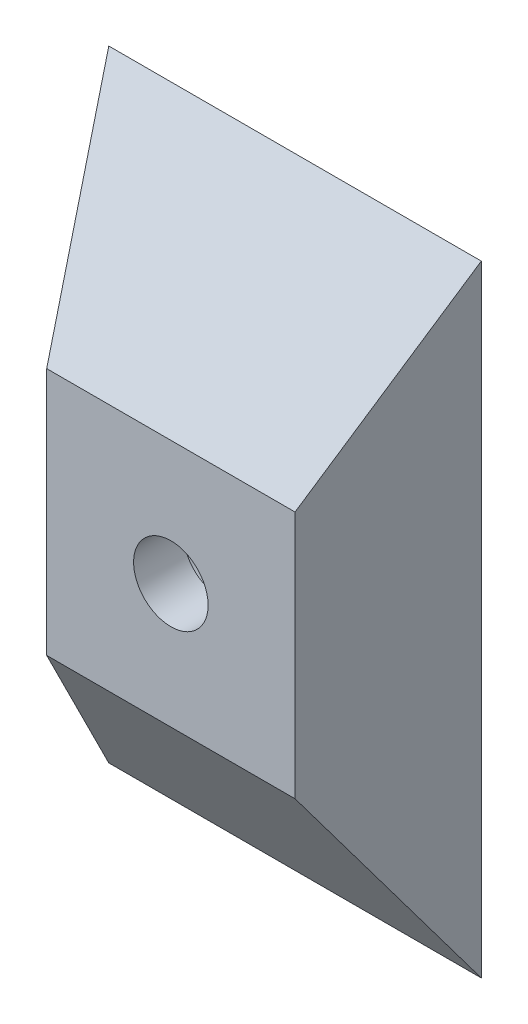
ISO-10303-21;
HEADER;
FILE_DESCRIPTION(('STEP AP214'),'2;1');
FILE_NAME('part.step','',(''),(''),'','','');
FILE_SCHEMA(('AUTOMOTIVE_DESIGN { 1 0 10303 214 1 1 1 1 }'));
ENDSEC;
DATA;
#1=APPLICATION_CONTEXT('core data for automotive mechanical design processes');
#2=APPLICATION_PROTOCOL_DEFINITION('international standard','automotive_design',2000,#1);
#3=PRODUCT_CONTEXT('',#1,'mechanical');
#4=PRODUCT('Part','Part','',(#3));
#5=PRODUCT_RELATED_PRODUCT_CATEGORY('part','',(#4));
#6=PRODUCT_DEFINITION_FORMATION('','',#4);
#7=PRODUCT_DEFINITION_CONTEXT('part definition',#1,'design');
#8=PRODUCT_DEFINITION('design','',#6,#7);
#9=PRODUCT_DEFINITION_SHAPE('','',#8);
#10=(LENGTH_UNIT() NAMED_UNIT(*) SI_UNIT(.MILLI.,.METRE.));
#11=(NAMED_UNIT(*) PLANE_ANGLE_UNIT() SI_UNIT($,.RADIAN.));
#12=(NAMED_UNIT(*) SI_UNIT($,.STERADIAN.) SOLID_ANGLE_UNIT());
#13=UNCERTAINTY_MEASURE_WITH_UNIT(LENGTH_MEASURE(1.E-05),#10,'distance_accuracy_value','');
#14=(GEOMETRIC_REPRESENTATION_CONTEXT(3) GLOBAL_UNCERTAINTY_ASSIGNED_CONTEXT((#13)) GLOBAL_UNIT_ASSIGNED_CONTEXT((#10,
#11,#12)) REPRESENTATION_CONTEXT('',''));
#15=CARTESIAN_POINT('',(0.,0.,0.));
#16=DIRECTION('',(0.,0.,1.));
#17=DIRECTION('',(1.,0.,0.));
#18=AXIS2_PLACEMENT_3D('',#15,#16,#17);
#19=CARTESIAN_POINT('',(0.,0.,0.));
#20=DIRECTION('',(0.,0.,1.));
#21=DIRECTION('',(1.,0.,0.));
#22=AXIS2_PLACEMENT_3D('',#19,#20,#21);
#23=CYLINDRICAL_SURFACE('',#22,1.5);
#24=CARTESIAN_POINT('',(0.,0.,5.));
#25=DIRECTION('',(0.,0.,1.));
#26=DIRECTION('',(1.,0.,0.));
#27=AXIS2_PLACEMENT_3D('',#24,#25,#26);
#28=CIRCLE('',#27,1.5);
#29=CARTESIAN_POINT('',(1.5,0.,5.));
#30=VERTEX_POINT('',#29);
#31=EDGE_CURVE('E237',#30,#30,#28,.T.);
#32=ORIENTED_EDGE('',*,*,#31,.T.);
#33=EDGE_LOOP('',(#32));
#34=FACE_BOUND('',#33,.T.);
#35=CARTESIAN_POINT('',(0.,0.,3.));
#36=DIRECTION('',(0.,0.,-1.));
#37=DIRECTION('',(-1.,0.,0.));
#38=AXIS2_PLACEMENT_3D('',#35,#36,#37);
#39=CIRCLE('',#38,1.5);
#40=CARTESIAN_POINT('',(-1.5,0.,3.));
#41=VERTEX_POINT('',#40);
#42=EDGE_CURVE('E51',#41,#41,#39,.F.);
#43=ORIENTED_EDGE('',*,*,#42,.F.);
#44=EDGE_LOOP('',(#43));
#45=FACE_BOUND('',#44,.T.);
#46=ADVANCED_FACE('F46',(#34,#45),#23,.F.);
#47=CARTESIAN_POINT('',(0.,0.,5.));
#48=DIRECTION('',(0.,0.,1.));
#49=DIRECTION('',(1.,0.,0.));
#50=AXIS2_PLACEMENT_3D('',#47,#48,#49);
#51=PLANE('',#50);
#52=ORIENTED_EDGE('',*,*,#31,.F.);
#53=EDGE_LOOP('',(#52));
#54=FACE_BOUND('',#53,.T.);
#55=DIRECTION('',(0.,1.,0.));
#56=VECTOR('',#55,1.);
#57=CARTESIAN_POINT('',(5.,5.,5.));
#58=LINE('',#57,#56);
#59=CARTESIAN_POINT('',(5.,-5.,5.));
#60=VERTEX_POINT('',#59);
#61=CARTESIAN_POINT('',(5.,5.,5.));
#62=VERTEX_POINT('',#61);
#63=EDGE_CURVE('E180',#60,#62,#58,.T.);
#64=ORIENTED_EDGE('',*,*,#63,.T.);
#65=DIRECTION('',(-1.,0.,0.));
#66=VECTOR('',#65,1.);
#67=CARTESIAN_POINT('',(-5.,5.,5.));
#68=LINE('',#67,#66);
#69=CARTESIAN_POINT('',(-5.,5.,5.));
#70=VERTEX_POINT('',#69);
#71=EDGE_CURVE('E82',#62,#70,#68,.T.);
#72=ORIENTED_EDGE('',*,*,#71,.T.);
#73=DIRECTION('',(0.,-1.,0.));
#74=VECTOR('',#73,1.);
#75=CARTESIAN_POINT('',(-5.,5.,5.));
#76=LINE('',#75,#74);
#77=CARTESIAN_POINT('',(-5.,-5.,5.));
#78=VERTEX_POINT('',#77);
#79=EDGE_CURVE('E157',#70,#78,#76,.T.);
#80=ORIENTED_EDGE('',*,*,#79,.T.);
#81=DIRECTION('',(1.,0.,0.));
#82=VECTOR('',#81,1.);
#83=CARTESIAN_POINT('',(-5.,-5.,5.));
#84=LINE('',#83,#82);
#85=EDGE_CURVE('E170',#78,#60,#84,.T.);
#86=ORIENTED_EDGE('',*,*,#85,.T.);
#87=EDGE_LOOP('',(#64,#72,#80,#86));
#88=FACE_BOUND('',#87,.T.);
#89=ADVANCED_FACE('F48',(#54,#88),#51,.T.);
#90=CARTESIAN_POINT('',(0.,0.,0.));
#91=DIRECTION('',(0.,0.,-1.));
#92=DIRECTION('',(-1.,0.,0.));
#93=AXIS2_PLACEMENT_3D('',#90,#91,#92);
#94=PLANE('',#93);
#95=CARTESIAN_POINT('',(0.,0.,0.));
#96=DIRECTION('',(0.,0.,-1.));
#97=DIRECTION('',(-1.,0.,0.));
#98=AXIS2_PLACEMENT_3D('',#95,#96,#97);
#99=CIRCLE('',#98,2.5);
#100=CARTESIAN_POINT('',(-2.5,0.,0.));
#101=VERTEX_POINT('',#100);
#102=EDGE_CURVE('E240',#101,#101,#99,.T.);
#103=ORIENTED_EDGE('',*,*,#102,.F.);
#104=EDGE_LOOP('',(#103));
#105=FACE_BOUND('',#104,.T.);
#106=DIRECTION('',(0.,1.,0.));
#107=VECTOR('',#106,1.);
#108=CARTESIAN_POINT('',(7.5,-12.5,0.));
#109=LINE('',#108,#107);
#110=CARTESIAN_POINT('',(7.5,-12.5,0.));
#111=VERTEX_POINT('',#110);
#112=CARTESIAN_POINT('',(7.5,12.5,0.));
#113=VERTEX_POINT('',#112);
#114=EDGE_CURVE('E100',#111,#113,#109,.T.);
#115=ORIENTED_EDGE('',*,*,#114,.F.);
#116=DIRECTION('',(1.,0.,0.));
#117=VECTOR('',#116,1.);
#118=CARTESIAN_POINT('',(-7.5,-12.5,0.));
#119=LINE('',#118,#117);
#120=CARTESIAN_POINT('',(-7.5,-12.5,0.));
#121=VERTEX_POINT('',#120);
#122=EDGE_CURVE('E12',#121,#111,#119,.T.);
#123=ORIENTED_EDGE('',*,*,#122,.F.);
#124=DIRECTION('',(0.,-1.,0.));
#125=VECTOR('',#124,1.);
#126=CARTESIAN_POINT('',(-7.5,-12.5,0.));
#127=LINE('',#126,#125);
#128=CARTESIAN_POINT('',(-7.5,12.5,0.));
#129=VERTEX_POINT('',#128);
#130=EDGE_CURVE('E57',#129,#121,#127,.T.);
#131=ORIENTED_EDGE('',*,*,#130,.F.);
#132=DIRECTION('',(-1.,0.,0.));
#133=VECTOR('',#132,1.);
#134=CARTESIAN_POINT('',(-7.5,12.5,0.));
#135=LINE('',#134,#133);
#136=EDGE_CURVE('E97',#113,#129,#135,.T.);
#137=ORIENTED_EDGE('',*,*,#136,.F.);
#138=EDGE_LOOP('',(#115,#123,#131,#137));
#139=FACE_BOUND('',#138,.T.);
#140=ADVANCED_FACE('F99',(#105,#139),#94,.T.);
#141=CARTESIAN_POINT('',(6.,0.,3.));
#142=DIRECTION('',(-0.894427190999916,0.,-0.447213595499958));
#143=DIRECTION('',(-0.447213595499958,0.,0.894427190999916));
#144=AXIS2_PLACEMENT_3D('',#141,#142,#143);
#145=PLANE('',#144);
#146=DIRECTION('',(-0.267261241912424,-0.801783725737273,0.534522483824849));
#147=VECTOR('',#146,1.);
#148=CARTESIAN_POINT('',(7.5,12.5,0.));
#149=LINE('',#148,#147);
#150=EDGE_CURVE('E88',#113,#62,#149,.T.);
#151=ORIENTED_EDGE('',*,*,#150,.T.);
#152=ORIENTED_EDGE('',*,*,#63,.F.);
#153=DIRECTION('',(-0.267261241912424,0.801783725737273,0.534522483824849));
#154=VECTOR('',#153,1.);
#155=CARTESIAN_POINT('',(7.5,-12.5,0.));
#156=LINE('',#155,#154);
#157=EDGE_CURVE('E66',#111,#60,#156,.T.);
#158=ORIENTED_EDGE('',*,*,#157,.F.);
#159=ORIENTED_EDGE('',*,*,#114,.T.);
#160=EDGE_LOOP('',(#151,#152,#158,#159));
#161=FACE_BOUND('',#160,.T.);
#162=ADVANCED_FACE('F110',(#161),#145,.F.);
#163=CARTESIAN_POINT('',(0.,-3.84615384615385,5.76923076923077));
#164=DIRECTION('',(0.,0.554700196225229,-0.832050294337844));
#165=DIRECTION('',(0.,0.832050294337844,0.554700196225229));
#166=AXIS2_PLACEMENT_3D('',#163,#164,#165);
#167=PLANE('',#166);
#168=ORIENTED_EDGE('',*,*,#157,.T.);
#169=ORIENTED_EDGE('',*,*,#85,.F.);
#170=DIRECTION('',(0.267261241912424,0.801783725737273,0.534522483824849));
#171=VECTOR('',#170,1.);
#172=CARTESIAN_POINT('',(-7.5,-12.5,0.));
#173=LINE('',#172,#171);
#174=EDGE_CURVE('E119',#121,#78,#173,.T.);
#175=ORIENTED_EDGE('',*,*,#174,.F.);
#176=ORIENTED_EDGE('',*,*,#122,.T.);
#177=EDGE_LOOP('',(#168,#169,#175,#176));
#178=FACE_BOUND('',#177,.T.);
#179=ADVANCED_FACE('F140',(#178),#167,.F.);
#180=CARTESIAN_POINT('',(0.,3.84615384615385,5.76923076923077));
#181=DIRECTION('',(0.,-0.554700196225229,-0.832050294337844));
#182=DIRECTION('',(0.,0.832050294337844,-0.554700196225229));
#183=AXIS2_PLACEMENT_3D('',#180,#181,#182);
#184=PLANE('',#183);
#185=DIRECTION('',(0.267261241912424,-0.801783725737273,0.534522483824849));
#186=VECTOR('',#185,1.);
#187=CARTESIAN_POINT('',(-7.5,12.5,0.));
#188=LINE('',#187,#186);
#189=EDGE_CURVE('E116',#129,#70,#188,.T.);
#190=ORIENTED_EDGE('',*,*,#189,.T.);
#191=ORIENTED_EDGE('',*,*,#71,.F.);
#192=ORIENTED_EDGE('',*,*,#150,.F.);
#193=ORIENTED_EDGE('',*,*,#136,.T.);
#194=EDGE_LOOP('',(#190,#191,#192,#193));
#195=FACE_BOUND('',#194,.T.);
#196=ADVANCED_FACE('F114',(#195),#184,.F.);
#197=CARTESIAN_POINT('',(-6.,0.,3.));
#198=DIRECTION('',(0.894427190999916,0.,-0.447213595499958));
#199=DIRECTION('',(-0.447213595499958,0.,-0.894427190999916));
#200=AXIS2_PLACEMENT_3D('',#197,#198,#199);
#201=PLANE('',#200);
#202=ORIENTED_EDGE('',*,*,#174,.T.);
#203=ORIENTED_EDGE('',*,*,#79,.F.);
#204=ORIENTED_EDGE('',*,*,#189,.F.);
#205=ORIENTED_EDGE('',*,*,#130,.T.);
#206=EDGE_LOOP('',(#202,#203,#204,#205));
#207=FACE_BOUND('',#206,.T.);
#208=ADVANCED_FACE('F139',(#207),#201,.F.);
#209=CARTESIAN_POINT('',(0.,0.,3.));
#210=DIRECTION('',(0.,0.,-1.));
#211=DIRECTION('',(-1.,0.,0.));
#212=AXIS2_PLACEMENT_3D('',#209,#210,#211);
#213=PLANE('',#212);
#214=CARTESIAN_POINT('',(0.,0.,3.));
#215=DIRECTION('',(0.,0.,-1.));
#216=DIRECTION('',(-1.,0.,0.));
#217=AXIS2_PLACEMENT_3D('',#214,#215,#216);
#218=CIRCLE('',#217,2.5);
#219=CARTESIAN_POINT('',(-2.5,0.,3.));
#220=VERTEX_POINT('',#219);
#221=EDGE_CURVE('E243',#220,#220,#218,.T.);
#222=ORIENTED_EDGE('',*,*,#221,.T.);
#223=EDGE_LOOP('',(#222));
#224=FACE_BOUND('',#223,.T.);
#225=ORIENTED_EDGE('',*,*,#42,.T.);
#226=EDGE_LOOP('',(#225));
#227=FACE_BOUND('',#226,.T.);
#228=ADVANCED_FACE('F250',(#224,#227),#213,.T.);
#229=CARTESIAN_POINT('',(0.,0.,3.));
#230=DIRECTION('',(0.,0.,-1.));
#231=DIRECTION('',(-1.,0.,0.));
#232=AXIS2_PLACEMENT_3D('',#229,#230,#231);
#233=CYLINDRICAL_SURFACE('',#232,2.5);
#234=ORIENTED_EDGE('',*,*,#221,.F.);
#235=EDGE_LOOP('',(#234));
#236=FACE_BOUND('',#235,.T.);
#237=ORIENTED_EDGE('',*,*,#102,.T.);
#238=EDGE_LOOP('',(#237));
#239=FACE_BOUND('',#238,.T.);
#240=ADVANCED_FACE('F341',(#236,#239),#233,.F.);
#241=CLOSED_SHELL('',(#46,#89,#140,#162,#179,#196,#208,#228,#240));
#242=MANIFOLD_SOLID_BREP('B2',#241);
#243=ADVANCED_BREP_SHAPE_REPRESENTATION('',(#18,#242),#14);
#244=SHAPE_DEFINITION_REPRESENTATION(#9,#243);
ENDSEC;
END-ISO-10303-21;
